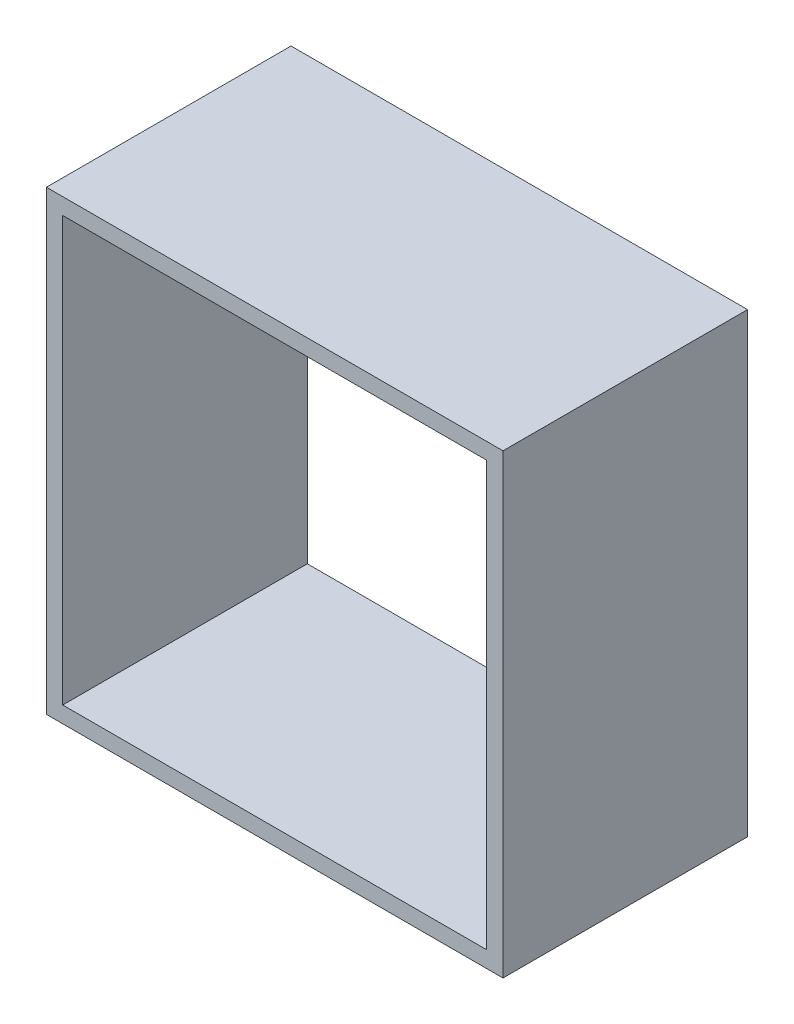
ISO-10303-21;
HEADER;
FILE_DESCRIPTION(('STEP AP214'),'2;1');
FILE_NAME('part.step','',(''),(''),'','','');
FILE_SCHEMA(('AUTOMOTIVE_DESIGN { 1 0 10303 214 1 1 1 1 }'));
ENDSEC;
DATA;
#1=APPLICATION_CONTEXT('core data for automotive mechanical design processes');
#2=APPLICATION_PROTOCOL_DEFINITION('international standard','automotive_design',2000,#1);
#3=PRODUCT_CONTEXT('',#1,'mechanical');
#4=PRODUCT('Part','Part','',(#3));
#5=PRODUCT_RELATED_PRODUCT_CATEGORY('part','',(#4));
#6=PRODUCT_DEFINITION_FORMATION('','',#4);
#7=PRODUCT_DEFINITION_CONTEXT('part definition',#1,'design');
#8=PRODUCT_DEFINITION('design','',#6,#7);
#9=PRODUCT_DEFINITION_SHAPE('','',#8);
#10=(LENGTH_UNIT() NAMED_UNIT(*) SI_UNIT(.MILLI.,.METRE.));
#11=(NAMED_UNIT(*) PLANE_ANGLE_UNIT() SI_UNIT($,.RADIAN.));
#12=(NAMED_UNIT(*) SI_UNIT($,.STERADIAN.) SOLID_ANGLE_UNIT());
#13=UNCERTAINTY_MEASURE_WITH_UNIT(LENGTH_MEASURE(1.E-05),#10,'distance_accuracy_value','');
#14=(GEOMETRIC_REPRESENTATION_CONTEXT(3) GLOBAL_UNCERTAINTY_ASSIGNED_CONTEXT((#13)) GLOBAL_UNIT_ASSIGNED_CONTEXT((#10,
#11,#12)) REPRESENTATION_CONTEXT('',''));
#15=CARTESIAN_POINT('',(0.,0.,0.));
#16=DIRECTION('',(0.,0.,1.));
#17=DIRECTION('',(1.,0.,0.));
#18=AXIS2_PLACEMENT_3D('',#15,#16,#17);
#19=CARTESIAN_POINT('',(0.,0.,15.));
#20=DIRECTION('',(0.,0.,1.));
#21=DIRECTION('',(1.,0.,0.));
#22=AXIS2_PLACEMENT_3D('',#19,#20,#21);
#23=PLANE('',#22);
#24=DIRECTION('',(0.,1.,0.));
#25=VECTOR('',#24,1.);
#26=CARTESIAN_POINT('',(14.,-14.,15.));
#27=LINE('',#26,#25);
#28=CARTESIAN_POINT('',(14.,-14.,15.));
#29=VERTEX_POINT('',#28);
#30=CARTESIAN_POINT('',(14.,14.,15.));
#31=VERTEX_POINT('',#30);
#32=EDGE_CURVE('E133',#29,#31,#27,.T.);
#33=ORIENTED_EDGE('',*,*,#32,.T.);
#34=DIRECTION('',(-1.,0.,0.));
#35=VECTOR('',#34,1.);
#36=CARTESIAN_POINT('',(14.,14.,15.));
#37=LINE('',#36,#35);
#38=CARTESIAN_POINT('',(-14.,14.,15.));
#39=VERTEX_POINT('',#38);
#40=EDGE_CURVE('E136',#31,#39,#37,.T.);
#41=ORIENTED_EDGE('',*,*,#40,.T.);
#42=DIRECTION('',(0.,-1.,0.));
#43=VECTOR('',#42,1.);
#44=CARTESIAN_POINT('',(-14.,-14.,15.));
#45=LINE('',#44,#43);
#46=CARTESIAN_POINT('',(-14.,-14.,15.));
#47=VERTEX_POINT('',#46);
#48=EDGE_CURVE('E139',#39,#47,#45,.T.);
#49=ORIENTED_EDGE('',*,*,#48,.T.);
#50=DIRECTION('',(1.,0.,0.));
#51=VECTOR('',#50,1.);
#52=CARTESIAN_POINT('',(14.,-14.,15.));
#53=LINE('',#52,#51);
#54=EDGE_CURVE('E141',#47,#29,#53,.T.);
#55=ORIENTED_EDGE('',*,*,#54,.T.);
#56=EDGE_LOOP('',(#33,#41,#49,#55));
#57=FACE_BOUND('',#56,.T.);
#58=DIRECTION('',(1.,0.,0.));
#59=VECTOR('',#58,1.);
#60=CARTESIAN_POINT('',(13.,-13.,15.));
#61=LINE('',#60,#59);
#62=CARTESIAN_POINT('',(-13.,-13.,15.));
#63=VERTEX_POINT('',#62);
#64=CARTESIAN_POINT('',(13.,-13.,15.));
#65=VERTEX_POINT('',#64);
#66=EDGE_CURVE('E105',#63,#65,#61,.T.);
#67=ORIENTED_EDGE('',*,*,#66,.F.);
#68=DIRECTION('',(0.,-1.,0.));
#69=VECTOR('',#68,1.);
#70=CARTESIAN_POINT('',(-13.,-13.,15.));
#71=LINE('',#70,#69);
#72=CARTESIAN_POINT('',(-13.,13.,15.));
#73=VERTEX_POINT('',#72);
#74=EDGE_CURVE('E97',#73,#63,#71,.T.);
#75=ORIENTED_EDGE('',*,*,#74,.F.);
#76=DIRECTION('',(-1.,0.,0.));
#77=VECTOR('',#76,1.);
#78=CARTESIAN_POINT('',(13.,13.,15.));
#79=LINE('',#78,#77);
#80=CARTESIAN_POINT('',(13.,13.,15.));
#81=VERTEX_POINT('',#80);
#82=EDGE_CURVE('E119',#81,#73,#79,.T.);
#83=ORIENTED_EDGE('',*,*,#82,.F.);
#84=DIRECTION('',(0.,1.,0.));
#85=VECTOR('',#84,1.);
#86=CARTESIAN_POINT('',(13.,-13.,15.));
#87=LINE('',#86,#85);
#88=EDGE_CURVE('E117',#65,#81,#87,.T.);
#89=ORIENTED_EDGE('',*,*,#88,.F.);
#90=EDGE_LOOP('',(#67,#75,#83,#89));
#91=FACE_BOUND('',#90,.T.);
#92=ADVANCED_FACE('F32',(#57,#91),#23,.T.);
#93=CARTESIAN_POINT('',(0.,0.,0.));
#94=DIRECTION('',(0.,0.,1.));
#95=DIRECTION('',(1.,0.,0.));
#96=AXIS2_PLACEMENT_3D('',#93,#94,#95);
#97=PLANE('',#96);
#98=DIRECTION('',(0.,1.,0.));
#99=VECTOR('',#98,1.);
#100=CARTESIAN_POINT('',(14.,-14.,0.));
#101=LINE('',#100,#99);
#102=CARTESIAN_POINT('',(14.,-14.,0.));
#103=VERTEX_POINT('',#102);
#104=CARTESIAN_POINT('',(14.,14.,0.));
#105=VERTEX_POINT('',#104);
#106=EDGE_CURVE('E113',#103,#105,#101,.T.);
#107=ORIENTED_EDGE('',*,*,#106,.F.);
#108=DIRECTION('',(1.,0.,0.));
#109=VECTOR('',#108,1.);
#110=CARTESIAN_POINT('',(14.,-14.,0.));
#111=LINE('',#110,#109);
#112=CARTESIAN_POINT('',(-14.,-14.,0.));
#113=VERTEX_POINT('',#112);
#114=EDGE_CURVE('E137',#113,#103,#111,.T.);
#115=ORIENTED_EDGE('',*,*,#114,.F.);
#116=DIRECTION('',(0.,-1.,0.));
#117=VECTOR('',#116,1.);
#118=CARTESIAN_POINT('',(-14.,-14.,0.));
#119=LINE('',#118,#117);
#120=CARTESIAN_POINT('',(-14.,14.,0.));
#121=VERTEX_POINT('',#120);
#122=EDGE_CURVE('E148',#121,#113,#119,.T.);
#123=ORIENTED_EDGE('',*,*,#122,.F.);
#124=DIRECTION('',(-1.,0.,0.));
#125=VECTOR('',#124,1.);
#126=CARTESIAN_POINT('',(14.,14.,0.));
#127=LINE('',#126,#125);
#128=EDGE_CURVE('E146',#105,#121,#127,.T.);
#129=ORIENTED_EDGE('',*,*,#128,.F.);
#130=EDGE_LOOP('',(#107,#115,#123,#129));
#131=FACE_BOUND('',#130,.T.);
#132=DIRECTION('',(0.,-1.,0.));
#133=VECTOR('',#132,1.);
#134=CARTESIAN_POINT('',(-13.,-13.,0.));
#135=LINE('',#134,#133);
#136=CARTESIAN_POINT('',(-13.,13.,0.));
#137=VERTEX_POINT('',#136);
#138=CARTESIAN_POINT('',(-13.,-13.,0.));
#139=VERTEX_POINT('',#138);
#140=EDGE_CURVE('E55',#137,#139,#135,.T.);
#141=ORIENTED_EDGE('',*,*,#140,.T.);
#142=DIRECTION('',(1.,0.,0.));
#143=VECTOR('',#142,1.);
#144=CARTESIAN_POINT('',(13.,-13.,0.));
#145=LINE('',#144,#143);
#146=CARTESIAN_POINT('',(13.,-13.,0.));
#147=VERTEX_POINT('',#146);
#148=EDGE_CURVE('E112',#139,#147,#145,.T.);
#149=ORIENTED_EDGE('',*,*,#148,.T.);
#150=DIRECTION('',(0.,1.,0.));
#151=VECTOR('',#150,1.);
#152=CARTESIAN_POINT('',(13.,-13.,0.));
#153=LINE('',#152,#151);
#154=CARTESIAN_POINT('',(13.,13.,0.));
#155=VERTEX_POINT('',#154);
#156=EDGE_CURVE('E125',#147,#155,#153,.T.);
#157=ORIENTED_EDGE('',*,*,#156,.T.);
#158=DIRECTION('',(-1.,0.,0.));
#159=VECTOR('',#158,1.);
#160=CARTESIAN_POINT('',(13.,13.,0.));
#161=LINE('',#160,#159);
#162=EDGE_CURVE('E106',#155,#137,#161,.T.);
#163=ORIENTED_EDGE('',*,*,#162,.T.);
#164=EDGE_LOOP('',(#141,#149,#157,#163));
#165=FACE_BOUND('',#164,.T.);
#166=ADVANCED_FACE('F166',(#131,#165),#97,.F.);
#167=CARTESIAN_POINT('',(14.,-14.,15.));
#168=DIRECTION('',(-1.,0.,0.));
#169=DIRECTION('',(0.,0.,1.));
#170=AXIS2_PLACEMENT_3D('',#167,#168,#169);
#171=PLANE('',#170);
#172=ORIENTED_EDGE('',*,*,#106,.T.);
#173=DIRECTION('',(0.,0.,-1.));
#174=VECTOR('',#173,1.);
#175=CARTESIAN_POINT('',(14.,14.,15.));
#176=LINE('',#175,#174);
#177=EDGE_CURVE('E11',#31,#105,#176,.T.);
#178=ORIENTED_EDGE('',*,*,#177,.F.);
#179=ORIENTED_EDGE('',*,*,#32,.F.);
#180=DIRECTION('',(0.,0.,-1.));
#181=VECTOR('',#180,1.);
#182=CARTESIAN_POINT('',(14.,-14.,15.));
#183=LINE('',#182,#181);
#184=EDGE_CURVE('E143',#29,#103,#183,.T.);
#185=ORIENTED_EDGE('',*,*,#184,.T.);
#186=EDGE_LOOP('',(#172,#178,#179,#185));
#187=FACE_BOUND('',#186,.T.);
#188=ADVANCED_FACE('F34',(#187),#171,.F.);
#189=CARTESIAN_POINT('',(14.,14.,15.));
#190=DIRECTION('',(0.,-1.,0.));
#191=DIRECTION('',(1.,0.,0.));
#192=AXIS2_PLACEMENT_3D('',#189,#190,#191);
#193=PLANE('',#192);
#194=ORIENTED_EDGE('',*,*,#128,.T.);
#195=DIRECTION('',(0.,0.,-1.));
#196=VECTOR('',#195,1.);
#197=CARTESIAN_POINT('',(-14.,14.,15.));
#198=LINE('',#197,#196);
#199=EDGE_CURVE('E40',#39,#121,#198,.T.);
#200=ORIENTED_EDGE('',*,*,#199,.F.);
#201=ORIENTED_EDGE('',*,*,#40,.F.);
#202=ORIENTED_EDGE('',*,*,#177,.T.);
#203=EDGE_LOOP('',(#194,#200,#201,#202));
#204=FACE_BOUND('',#203,.T.);
#205=ADVANCED_FACE('F176',(#204),#193,.F.);
#206=CARTESIAN_POINT('',(-14.,-14.,15.));
#207=DIRECTION('',(1.,0.,0.));
#208=DIRECTION('',(0.,1.,0.));
#209=AXIS2_PLACEMENT_3D('',#206,#207,#208);
#210=PLANE('',#209);
#211=ORIENTED_EDGE('',*,*,#122,.T.);
#212=DIRECTION('',(0.,0.,-1.));
#213=VECTOR('',#212,1.);
#214=CARTESIAN_POINT('',(-14.,-14.,15.));
#215=LINE('',#214,#213);
#216=EDGE_CURVE('E153',#47,#113,#215,.T.);
#217=ORIENTED_EDGE('',*,*,#216,.F.);
#218=ORIENTED_EDGE('',*,*,#48,.F.);
#219=ORIENTED_EDGE('',*,*,#199,.T.);
#220=EDGE_LOOP('',(#211,#217,#218,#219));
#221=FACE_BOUND('',#220,.T.);
#222=ADVANCED_FACE('F160',(#221),#210,.F.);
#223=CARTESIAN_POINT('',(14.,-14.,15.));
#224=DIRECTION('',(0.,1.,0.));
#225=DIRECTION('',(-1.,0.,0.));
#226=AXIS2_PLACEMENT_3D('',#223,#224,#225);
#227=PLANE('',#226);
#228=ORIENTED_EDGE('',*,*,#114,.T.);
#229=ORIENTED_EDGE('',*,*,#184,.F.);
#230=ORIENTED_EDGE('',*,*,#54,.F.);
#231=ORIENTED_EDGE('',*,*,#216,.T.);
#232=EDGE_LOOP('',(#228,#229,#230,#231));
#233=FACE_BOUND('',#232,.T.);
#234=ADVANCED_FACE('F170',(#233),#227,.F.);
#235=CARTESIAN_POINT('',(-13.,-13.,15.));
#236=DIRECTION('',(1.,0.,0.));
#237=DIRECTION('',(0.,0.,-1.));
#238=AXIS2_PLACEMENT_3D('',#235,#236,#237);
#239=PLANE('',#238);
#240=ORIENTED_EDGE('',*,*,#140,.F.);
#241=DIRECTION('',(0.,0.,-1.));
#242=VECTOR('',#241,1.);
#243=CARTESIAN_POINT('',(-13.,13.,15.));
#244=LINE('',#243,#242);
#245=EDGE_CURVE('E101',#73,#137,#244,.T.);
#246=ORIENTED_EDGE('',*,*,#245,.F.);
#247=ORIENTED_EDGE('',*,*,#74,.T.);
#248=DIRECTION('',(0.,0.,-1.));
#249=VECTOR('',#248,1.);
#250=CARTESIAN_POINT('',(-13.,-13.,15.));
#251=LINE('',#250,#249);
#252=EDGE_CURVE('E100',#63,#139,#251,.T.);
#253=ORIENTED_EDGE('',*,*,#252,.T.);
#254=EDGE_LOOP('',(#240,#246,#247,#253));
#255=FACE_BOUND('',#254,.T.);
#256=ADVANCED_FACE('F99',(#255),#239,.T.);
#257=CARTESIAN_POINT('',(13.,-13.,15.));
#258=DIRECTION('',(0.,1.,0.));
#259=DIRECTION('',(-1.,0.,0.));
#260=AXIS2_PLACEMENT_3D('',#257,#258,#259);
#261=PLANE('',#260);
#262=ORIENTED_EDGE('',*,*,#148,.F.);
#263=ORIENTED_EDGE('',*,*,#252,.F.);
#264=ORIENTED_EDGE('',*,*,#66,.T.);
#265=DIRECTION('',(0.,0.,-1.));
#266=VECTOR('',#265,1.);
#267=CARTESIAN_POINT('',(13.,-13.,15.));
#268=LINE('',#267,#266);
#269=EDGE_CURVE('E114',#65,#147,#268,.T.);
#270=ORIENTED_EDGE('',*,*,#269,.T.);
#271=EDGE_LOOP('',(#262,#263,#264,#270));
#272=FACE_BOUND('',#271,.T.);
#273=ADVANCED_FACE('F109',(#272),#261,.T.);
#274=CARTESIAN_POINT('',(13.,-13.,15.));
#275=DIRECTION('',(-1.,0.,0.));
#276=DIRECTION('',(0.,0.,1.));
#277=AXIS2_PLACEMENT_3D('',#274,#275,#276);
#278=PLANE('',#277);
#279=ORIENTED_EDGE('',*,*,#156,.F.);
#280=ORIENTED_EDGE('',*,*,#269,.F.);
#281=ORIENTED_EDGE('',*,*,#88,.T.);
#282=DIRECTION('',(0.,0.,-1.));
#283=VECTOR('',#282,1.);
#284=CARTESIAN_POINT('',(13.,13.,15.));
#285=LINE('',#284,#283);
#286=EDGE_CURVE('E47',#81,#155,#285,.T.);
#287=ORIENTED_EDGE('',*,*,#286,.T.);
#288=EDGE_LOOP('',(#279,#280,#281,#287));
#289=FACE_BOUND('',#288,.T.);
#290=ADVANCED_FACE('F199',(#289),#278,.T.);
#291=CARTESIAN_POINT('',(13.,13.,15.));
#292=DIRECTION('',(0.,-1.,0.));
#293=DIRECTION('',(1.,0.,0.));
#294=AXIS2_PLACEMENT_3D('',#291,#292,#293);
#295=PLANE('',#294);
#296=ORIENTED_EDGE('',*,*,#162,.F.);
#297=ORIENTED_EDGE('',*,*,#286,.F.);
#298=ORIENTED_EDGE('',*,*,#82,.T.);
#299=ORIENTED_EDGE('',*,*,#245,.T.);
#300=EDGE_LOOP('',(#296,#297,#298,#299));
#301=FACE_BOUND('',#300,.T.);
#302=ADVANCED_FACE('F203',(#301),#295,.T.);
#303=CLOSED_SHELL('',(#92,#166,#188,#205,#222,#234,#256,#273,#290,#302));
#304=MANIFOLD_SOLID_BREP('B2',#303);
#305=ADVANCED_BREP_SHAPE_REPRESENTATION('',(#18,#304),#14);
#306=SHAPE_DEFINITION_REPRESENTATION(#9,#305);
ENDSEC;
END-ISO-10303-21;
